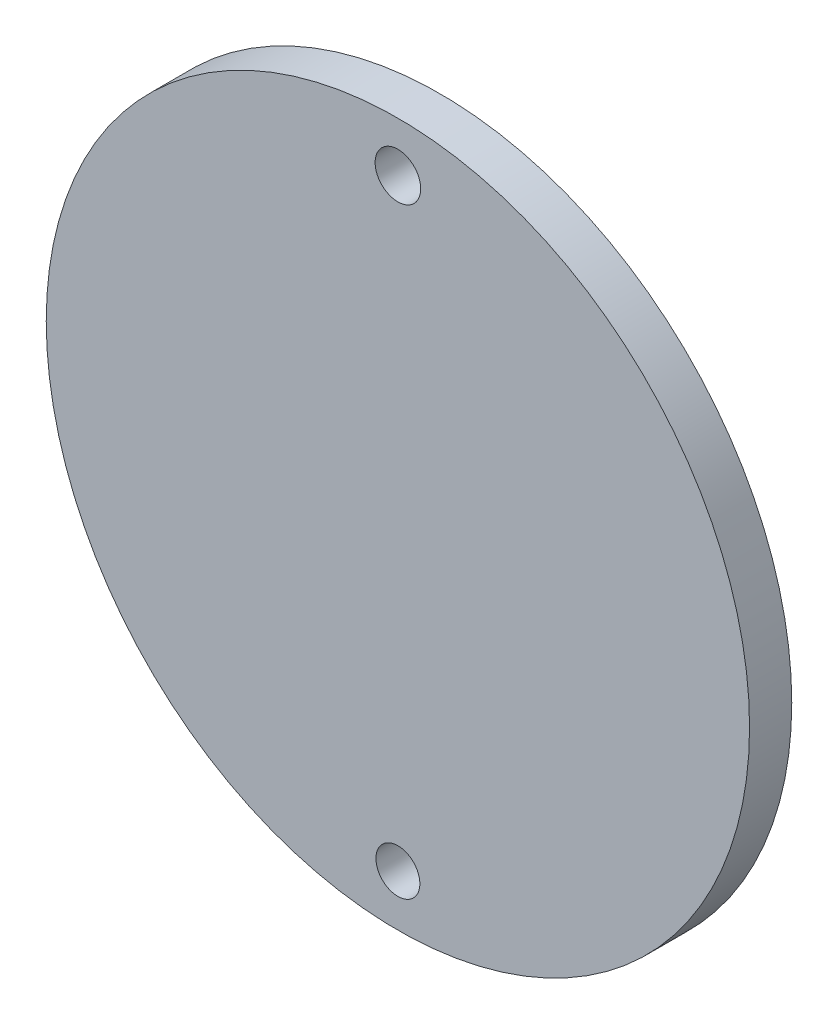
ISO-10303-21;
HEADER;
FILE_DESCRIPTION(('STEP AP214'),'2;1');
FILE_NAME('part.step','',(''),(''),'','','');
FILE_SCHEMA(('AUTOMOTIVE_DESIGN { 1 0 10303 214 1 1 1 1 }'));
ENDSEC;
DATA;
#1=APPLICATION_CONTEXT('core data for automotive mechanical design processes');
#2=APPLICATION_PROTOCOL_DEFINITION('international standard','automotive_design',2000,#1);
#3=PRODUCT_CONTEXT('',#1,'mechanical');
#4=PRODUCT('Part','Part','',(#3));
#5=PRODUCT_RELATED_PRODUCT_CATEGORY('part','',(#4));
#6=PRODUCT_DEFINITION_FORMATION('','',#4);
#7=PRODUCT_DEFINITION_CONTEXT('part definition',#1,'design');
#8=PRODUCT_DEFINITION('design','',#6,#7);
#9=PRODUCT_DEFINITION_SHAPE('','',#8);
#10=(LENGTH_UNIT() NAMED_UNIT(*) SI_UNIT(.MILLI.,.METRE.));
#11=(NAMED_UNIT(*) PLANE_ANGLE_UNIT() SI_UNIT($,.RADIAN.));
#12=(NAMED_UNIT(*) SI_UNIT($,.STERADIAN.) SOLID_ANGLE_UNIT());
#13=UNCERTAINTY_MEASURE_WITH_UNIT(LENGTH_MEASURE(1.E-05),#10,'distance_accuracy_value','');
#14=(GEOMETRIC_REPRESENTATION_CONTEXT(3) GLOBAL_UNCERTAINTY_ASSIGNED_CONTEXT((#13)) GLOBAL_UNIT_ASSIGNED_CONTEXT((#10,
#11,#12)) REPRESENTATION_CONTEXT('',''));
#15=CARTESIAN_POINT('',(0.,0.,0.));
#16=DIRECTION('',(0.,0.,1.));
#17=DIRECTION('',(1.,0.,0.));
#18=AXIS2_PLACEMENT_3D('',#15,#16,#17);
#19=CARTESIAN_POINT('',(32.4706629925765,38.3744199003177,3.));
#20=DIRECTION('',(0.,0.,1.));
#21=DIRECTION('',(1.,0.,0.));
#22=AXIS2_PLACEMENT_3D('',#19,#20,#21);
#23=PLANE('',#22);
#24=CARTESIAN_POINT('',(32.4706629925765,17.0194069970364,3.));
#25=DIRECTION('',(0.,0.,1.));
#26=DIRECTION('',(1.,0.,0.));
#27=AXIS2_PLACEMENT_3D('',#24,#25,#26);
#28=CIRCLE('',#27,1.56122643918112);
#29=CARTESIAN_POINT('',(34.0318894317576,17.0194069970364,3.));
#30=VERTEX_POINT('',#29);
#31=EDGE_CURVE('E42',#30,#30,#28,.T.);
#32=ORIENTED_EDGE('',*,*,#31,.F.);
#33=EDGE_LOOP('',(#32));
#34=FACE_BOUND('',#33,.T.);
#35=CARTESIAN_POINT('',(32.4706629925765,38.3744199003177,3.));
#36=DIRECTION('',(0.,0.,1.));
#37=DIRECTION('',(1.,0.,0.));
#38=AXIS2_PLACEMENT_3D('',#35,#36,#37);
#39=CIRCLE('',#38,25.);
#40=CARTESIAN_POINT('',(57.4706629925765,38.3744199003177,3.));
#41=VERTEX_POINT('',#40);
#42=EDGE_CURVE('E10',#41,#41,#39,.T.);
#43=ORIENTED_EDGE('',*,*,#42,.T.);
#44=EDGE_LOOP('',(#43));
#45=FACE_BOUND('',#44,.T.);
#46=CARTESIAN_POINT('',(32.4706629925765,59.8346155221066,3.));
#47=DIRECTION('',(0.,0.,1.));
#48=DIRECTION('',(1.,0.,0.));
#49=AXIS2_PLACEMENT_3D('',#46,#47,#48);
#50=CIRCLE('',#49,1.61996485456939);
#51=CARTESIAN_POINT('',(34.0906278471459,59.8346155221066,3.));
#52=VERTEX_POINT('',#51);
#53=EDGE_CURVE('E47',#52,#52,#50,.T.);
#54=ORIENTED_EDGE('',*,*,#53,.F.);
#55=EDGE_LOOP('',(#54));
#56=FACE_BOUND('',#55,.T.);
#57=ADVANCED_FACE('F31',(#34,#45,#56),#23,.T.);
#58=CARTESIAN_POINT('',(32.4706629925765,38.3744199003177,0.));
#59=DIRECTION('',(0.,0.,1.));
#60=DIRECTION('',(1.,0.,0.));
#61=AXIS2_PLACEMENT_3D('',#58,#59,#60);
#62=PLANE('',#61);
#63=CARTESIAN_POINT('',(32.4706629925765,17.0194069970364,0.));
#64=DIRECTION('',(0.,0.,1.));
#65=DIRECTION('',(1.,0.,0.));
#66=AXIS2_PLACEMENT_3D('',#63,#64,#65);
#67=CIRCLE('',#66,1.56122643918112);
#68=CARTESIAN_POINT('',(34.0318894317576,17.0194069970364,0.));
#69=VERTEX_POINT('',#68);
#70=EDGE_CURVE('E44',#69,#69,#67,.T.);
#71=ORIENTED_EDGE('',*,*,#70,.T.);
#72=EDGE_LOOP('',(#71));
#73=FACE_BOUND('',#72,.T.);
#74=CARTESIAN_POINT('',(32.4706629925765,38.3744199003177,0.));
#75=DIRECTION('',(0.,0.,1.));
#76=DIRECTION('',(1.,0.,0.));
#77=AXIS2_PLACEMENT_3D('',#74,#75,#76);
#78=CIRCLE('',#77,25.);
#79=CARTESIAN_POINT('',(57.4706629925765,38.3744199003177,0.));
#80=VERTEX_POINT('',#79);
#81=EDGE_CURVE('E35',#80,#80,#78,.T.);
#82=ORIENTED_EDGE('',*,*,#81,.F.);
#83=EDGE_LOOP('',(#82));
#84=FACE_BOUND('',#83,.T.);
#85=CARTESIAN_POINT('',(32.4706629925765,59.8346155221066,0.));
#86=DIRECTION('',(0.,0.,1.));
#87=DIRECTION('',(1.,0.,0.));
#88=AXIS2_PLACEMENT_3D('',#85,#86,#87);
#89=CIRCLE('',#88,1.61996485456939);
#90=CARTESIAN_POINT('',(34.0906278471459,59.8346155221066,0.));
#91=VERTEX_POINT('',#90);
#92=EDGE_CURVE('E50',#91,#91,#89,.T.);
#93=ORIENTED_EDGE('',*,*,#92,.T.);
#94=EDGE_LOOP('',(#93));
#95=FACE_BOUND('',#94,.T.);
#96=ADVANCED_FACE('F60',(#73,#84,#95),#62,.F.);
#97=CARTESIAN_POINT('',(32.4706629925765,38.3744199003177,3.));
#98=DIRECTION('',(0.,0.,-1.));
#99=DIRECTION('',(-1.,0.,0.));
#100=AXIS2_PLACEMENT_3D('',#97,#98,#99);
#101=CYLINDRICAL_SURFACE('',#100,25.);
#102=ORIENTED_EDGE('',*,*,#42,.F.);
#103=EDGE_LOOP('',(#102));
#104=FACE_BOUND('',#103,.T.);
#105=ORIENTED_EDGE('',*,*,#81,.T.);
#106=EDGE_LOOP('',(#105));
#107=FACE_BOUND('',#106,.T.);
#108=ADVANCED_FACE('F33',(#104,#107),#101,.T.);
#109=CARTESIAN_POINT('',(32.4706629925765,17.0194069970364,3.));
#110=DIRECTION('',(0.,0.,-1.));
#111=DIRECTION('',(-1.,0.,0.));
#112=AXIS2_PLACEMENT_3D('',#109,#110,#111);
#113=CYLINDRICAL_SURFACE('',#112,1.56122643918112);
#114=ORIENTED_EDGE('',*,*,#31,.T.);
#115=EDGE_LOOP('',(#114));
#116=FACE_BOUND('',#115,.T.);
#117=ORIENTED_EDGE('',*,*,#70,.F.);
#118=EDGE_LOOP('',(#117));
#119=FACE_BOUND('',#118,.T.);
#120=ADVANCED_FACE('F69',(#116,#119),#113,.F.);
#121=CARTESIAN_POINT('',(32.4706629925765,59.8346155221066,3.));
#122=DIRECTION('',(0.,0.,-1.));
#123=DIRECTION('',(-1.,0.,0.));
#124=AXIS2_PLACEMENT_3D('',#121,#122,#123);
#125=CYLINDRICAL_SURFACE('',#124,1.61996485456939);
#126=ORIENTED_EDGE('',*,*,#53,.T.);
#127=EDGE_LOOP('',(#126));
#128=FACE_BOUND('',#127,.T.);
#129=ORIENTED_EDGE('',*,*,#92,.F.);
#130=EDGE_LOOP('',(#129));
#131=FACE_BOUND('',#130,.T.);
#132=ADVANCED_FACE('F56',(#128,#131),#125,.F.);
#133=CLOSED_SHELL('',(#57,#96,#108,#120,#132));
#134=MANIFOLD_SOLID_BREP('B2',#133);
#135=ADVANCED_BREP_SHAPE_REPRESENTATION('',(#18,#134),#14);
#136=SHAPE_DEFINITION_REPRESENTATION(#9,#135);
ENDSEC;
END-ISO-10303-21;
